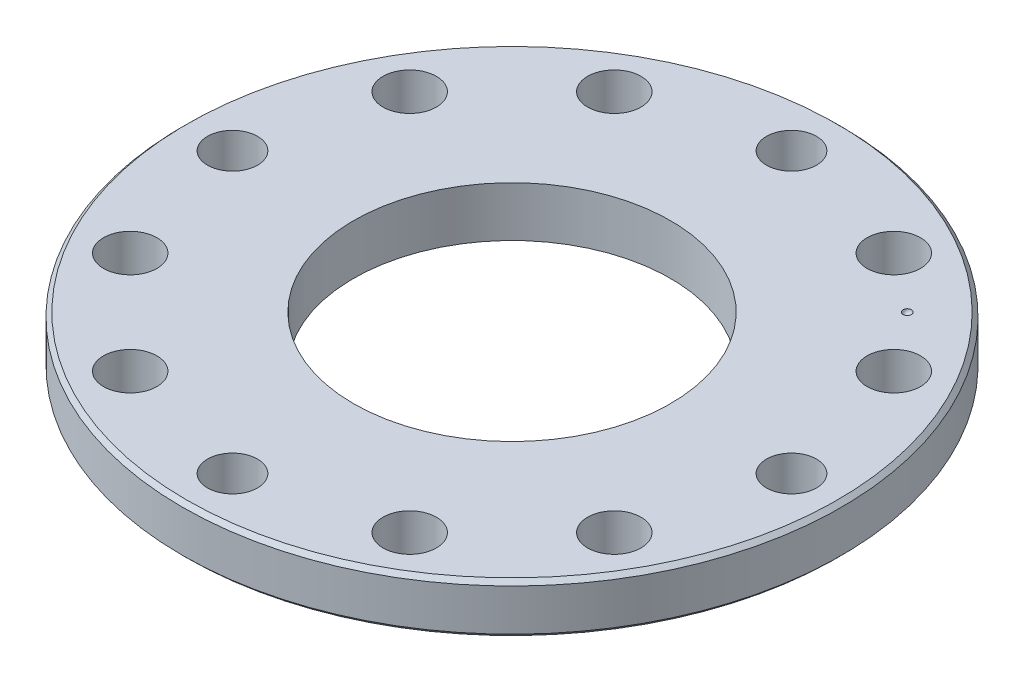
ISO-10303-21;
HEADER;
FILE_DESCRIPTION(('STEP AP214'),'2;1');
FILE_NAME('part.step','',(''),(''),'','','');
FILE_SCHEMA(('AUTOMOTIVE_DESIGN { 1 0 10303 214 1 1 1 1 }'));
ENDSEC;
DATA;
#1=APPLICATION_CONTEXT('core data for automotive mechanical design processes');
#2=APPLICATION_PROTOCOL_DEFINITION('international standard','automotive_design',2000,#1);
#3=PRODUCT_CONTEXT('',#1,'mechanical');
#4=PRODUCT('Part','Part','',(#3));
#5=PRODUCT_RELATED_PRODUCT_CATEGORY('part','',(#4));
#6=PRODUCT_DEFINITION_FORMATION('','',#4);
#7=PRODUCT_DEFINITION_CONTEXT('part definition',#1,'design');
#8=PRODUCT_DEFINITION('design','',#6,#7);
#9=PRODUCT_DEFINITION_SHAPE('','',#8);
#10=(LENGTH_UNIT() NAMED_UNIT(*) SI_UNIT(.MILLI.,.METRE.));
#11=(NAMED_UNIT(*) PLANE_ANGLE_UNIT() SI_UNIT($,.RADIAN.));
#12=(NAMED_UNIT(*) SI_UNIT($,.STERADIAN.) SOLID_ANGLE_UNIT());
#13=UNCERTAINTY_MEASURE_WITH_UNIT(LENGTH_MEASURE(1.E-05),#10,'distance_accuracy_value','');
#14=(GEOMETRIC_REPRESENTATION_CONTEXT(3) GLOBAL_UNCERTAINTY_ASSIGNED_CONTEXT((#13)) GLOBAL_UNIT_ASSIGNED_CONTEXT((#10,
#11,#12)) REPRESENTATION_CONTEXT('',''));
#15=CARTESIAN_POINT('',(0.,0.,0.));
#16=DIRECTION('',(0.,0.,1.));
#17=DIRECTION('',(1.,0.,0.));
#18=AXIS2_PLACEMENT_3D('',#15,#16,#17);
#19=CARTESIAN_POINT('',(0.,-6.,0.));
#20=DIRECTION('',(0.,1.,0.));
#21=DIRECTION('',(0.,0.,1.));
#22=AXIS2_PLACEMENT_3D('',#19,#20,#21);
#23=CYLINDRICAL_SURFACE('',#22,39.5);
#24=CARTESIAN_POINT('',(0.,-0.49999999999998,0.));
#25=DIRECTION('',(0.,1.,0.));
#26=DIRECTION('',(0.,0.,1.));
#27=AXIS2_PLACEMENT_3D('',#24,#25,#26);
#28=CIRCLE('',#27,39.5);
#29=CARTESIAN_POINT('',(0.,-0.49999999999998,39.5));
#30=VERTEX_POINT('',#29);
#31=EDGE_CURVE('E38',#30,#30,#28,.F.);
#32=ORIENTED_EDGE('',*,*,#31,.T.);
#33=EDGE_LOOP('',(#32));
#34=FACE_BOUND('',#33,.T.);
#35=CARTESIAN_POINT('',(0.,-5.49999999999999,0.));
#36=DIRECTION('',(0.,1.,0.));
#37=DIRECTION('',(0.,0.,1.));
#38=AXIS2_PLACEMENT_3D('',#35,#36,#37);
#39=CIRCLE('',#38,39.5);
#40=CARTESIAN_POINT('',(0.,-5.49999999999999,39.5));
#41=VERTEX_POINT('',#40);
#42=EDGE_CURVE('E42',#41,#41,#39,.T.);
#43=ORIENTED_EDGE('',*,*,#42,.T.);
#44=EDGE_LOOP('',(#43));
#45=FACE_BOUND('',#44,.T.);
#46=ADVANCED_FACE('F30',(#34,#45),#23,.T.);
#47=CARTESIAN_POINT('',(0.,-6.,0.));
#48=DIRECTION('',(0.,1.,0.));
#49=DIRECTION('',(0.,0.,1.));
#50=AXIS2_PLACEMENT_3D('',#47,#48,#49);
#51=PLANE('',#50);
#52=CARTESIAN_POINT('',(0.,-6.,0.));
#53=DIRECTION('',(0.,1.,0.));
#54=DIRECTION('',(0.,0.,1.));
#55=AXIS2_PLACEMENT_3D('',#52,#53,#54);
#56=CIRCLE('',#55,39.);
#57=CARTESIAN_POINT('',(0.,-6.,39.));
#58=VERTEX_POINT('',#57);
#59=EDGE_CURVE('E10',#58,#58,#56,.F.);
#60=ORIENTED_EDGE('',*,*,#59,.T.);
#61=EDGE_LOOP('',(#60));
#62=FACE_BOUND('',#61,.T.);
#63=CARTESIAN_POINT('',(-16.75,-6.,29.0118510267787));
#64=DIRECTION('',(0.,1.,0.));
#65=DIRECTION('',(0.,0.,1.));
#66=AXIS2_PLACEMENT_3D('',#63,#64,#65);
#67=CIRCLE('',#66,3.2);
#68=CARTESIAN_POINT('',(-16.75,-6.,32.2118510267787));
#69=VERTEX_POINT('',#68);
#70=EDGE_CURVE('E122',#69,#69,#67,.T.);
#71=ORIENTED_EDGE('',*,*,#70,.T.);
#72=EDGE_LOOP('',(#71));
#73=FACE_BOUND('',#72,.T.);
#74=CARTESIAN_POINT('',(-29.0118510267787,-6.,-16.75));
#75=DIRECTION('',(0.,1.,0.));
#76=DIRECTION('',(0.,0.,1.));
#77=AXIS2_PLACEMENT_3D('',#74,#75,#76);
#78=CIRCLE('',#77,3.2);
#79=CARTESIAN_POINT('',(-29.0118510267787,-6.,-13.55));
#80=VERTEX_POINT('',#79);
#81=EDGE_CURVE('E116',#80,#80,#78,.T.);
#82=ORIENTED_EDGE('',*,*,#81,.T.);
#83=EDGE_LOOP('',(#82));
#84=FACE_BOUND('',#83,.T.);
#85=CARTESIAN_POINT('',(16.75,-6.,-29.0118510267787));
#86=DIRECTION('',(0.,1.,0.));
#87=DIRECTION('',(0.,0.,1.));
#88=AXIS2_PLACEMENT_3D('',#85,#86,#87);
#89=CIRCLE('',#88,3.2);
#90=CARTESIAN_POINT('',(16.75,-6.,-25.8118510267787));
#91=VERTEX_POINT('',#90);
#92=EDGE_CURVE('E110',#91,#91,#89,.T.);
#93=ORIENTED_EDGE('',*,*,#92,.T.);
#94=EDGE_LOOP('',(#93));
#95=FACE_BOUND('',#94,.T.);
#96=CARTESIAN_POINT('',(29.0118510267787,-6.,16.75));
#97=DIRECTION('',(0.,1.,0.));
#98=DIRECTION('',(0.,0.,1.));
#99=AXIS2_PLACEMENT_3D('',#96,#97,#98);
#100=CIRCLE('',#99,3.2);
#101=CARTESIAN_POINT('',(29.0118510267787,-6.,19.95));
#102=VERTEX_POINT('',#101);
#103=EDGE_CURVE('E104',#102,#102,#100,.T.);
#104=ORIENTED_EDGE('',*,*,#103,.T.);
#105=EDGE_LOOP('',(#104));
#106=FACE_BOUND('',#105,.T.);
#107=CARTESIAN_POINT('',(-16.75,-6.,-29.0118510267787));
#108=DIRECTION('',(0.,1.,0.));
#109=DIRECTION('',(0.,0.,1.));
#110=AXIS2_PLACEMENT_3D('',#107,#108,#109);
#111=CIRCLE('',#110,3.2);
#112=CARTESIAN_POINT('',(-16.75,-6.,-25.8118510267787));
#113=VERTEX_POINT('',#112);
#114=EDGE_CURVE('E98',#113,#113,#111,.T.);
#115=ORIENTED_EDGE('',*,*,#114,.T.);
#116=EDGE_LOOP('',(#115));
#117=FACE_BOUND('',#116,.T.);
#118=CARTESIAN_POINT('',(29.0118510267787,-6.,-16.75));
#119=DIRECTION('',(0.,1.,0.));
#120=DIRECTION('',(0.,0.,1.));
#121=AXIS2_PLACEMENT_3D('',#118,#119,#120);
#122=CIRCLE('',#121,3.2);
#123=CARTESIAN_POINT('',(29.0118510267787,-6.,-13.55));
#124=VERTEX_POINT('',#123);
#125=EDGE_CURVE('E92',#124,#124,#122,.T.);
#126=ORIENTED_EDGE('',*,*,#125,.T.);
#127=EDGE_LOOP('',(#126));
#128=FACE_BOUND('',#127,.T.);
#129=CARTESIAN_POINT('',(16.75,-6.,29.0118510267787));
#130=DIRECTION('',(0.,1.,0.));
#131=DIRECTION('',(0.,0.,1.));
#132=AXIS2_PLACEMENT_3D('',#129,#130,#131);
#133=CIRCLE('',#132,3.2);
#134=CARTESIAN_POINT('',(16.75,-6.,32.2118510267787));
#135=VERTEX_POINT('',#134);
#136=EDGE_CURVE('E86',#135,#135,#133,.T.);
#137=ORIENTED_EDGE('',*,*,#136,.T.);
#138=EDGE_LOOP('',(#137));
#139=FACE_BOUND('',#138,.T.);
#140=CARTESIAN_POINT('',(-29.0118510267787,-6.,16.75));
#141=DIRECTION('',(0.,1.,0.));
#142=DIRECTION('',(0.,0.,1.));
#143=AXIS2_PLACEMENT_3D('',#140,#141,#142);
#144=CIRCLE('',#143,3.2);
#145=CARTESIAN_POINT('',(-29.0118510267787,-6.,19.95));
#146=VERTEX_POINT('',#145);
#147=EDGE_CURVE('E78',#146,#146,#144,.T.);
#148=ORIENTED_EDGE('',*,*,#147,.T.);
#149=EDGE_LOOP('',(#148));
#150=FACE_BOUND('',#149,.T.);
#151=CARTESIAN_POINT('',(0.,-6.,33.5));
#152=DIRECTION('',(0.,1.,0.));
#153=DIRECTION('',(0.,0.,1.));
#154=AXIS2_PLACEMENT_3D('',#151,#152,#153);
#155=CIRCLE('',#154,3.00000000000036);
#156=CARTESIAN_POINT('',(0.,-6.,36.5000000000004));
#157=VERTEX_POINT('',#156);
#158=EDGE_CURVE('E72',#157,#157,#155,.T.);
#159=ORIENTED_EDGE('',*,*,#158,.T.);
#160=EDGE_LOOP('',(#159));
#161=FACE_BOUND('',#160,.T.);
#162=CARTESIAN_POINT('',(-33.5,-6.,0.));
#163=DIRECTION('',(0.,1.,0.));
#164=DIRECTION('',(0.,0.,1.));
#165=AXIS2_PLACEMENT_3D('',#162,#163,#164);
#166=CIRCLE('',#165,2.9999999999999);
#167=CARTESIAN_POINT('',(-33.5,-6.,2.9999999999999));
#168=VERTEX_POINT('',#167);
#169=EDGE_CURVE('E66',#168,#168,#166,.T.);
#170=ORIENTED_EDGE('',*,*,#169,.T.);
#171=EDGE_LOOP('',(#170));
#172=FACE_BOUND('',#171,.T.);
#173=CARTESIAN_POINT('',(33.5,-6.,0.));
#174=DIRECTION('',(0.,1.,0.));
#175=DIRECTION('',(0.,0.,1.));
#176=AXIS2_PLACEMENT_3D('',#173,#174,#175);
#177=CIRCLE('',#176,3.00000000000011);
#178=CARTESIAN_POINT('',(33.5,-6.,3.00000000000011));
#179=VERTEX_POINT('',#178);
#180=EDGE_CURVE('E60',#179,#179,#177,.T.);
#181=ORIENTED_EDGE('',*,*,#180,.T.);
#182=EDGE_LOOP('',(#181));
#183=FACE_BOUND('',#182,.T.);
#184=CARTESIAN_POINT('',(0.,-6.,-33.5));
#185=DIRECTION('',(0.,1.,0.));
#186=DIRECTION('',(0.,0.,1.));
#187=AXIS2_PLACEMENT_3D('',#184,#185,#186);
#188=CIRCLE('',#187,2.99999999999964);
#189=CARTESIAN_POINT('',(0.,-6.,-30.5000000000004));
#190=VERTEX_POINT('',#189);
#191=EDGE_CURVE('E54',#190,#190,#188,.T.);
#192=ORIENTED_EDGE('',*,*,#191,.T.);
#193=EDGE_LOOP('',(#192));
#194=FACE_BOUND('',#193,.T.);
#195=CARTESIAN_POINT('',(0.,-6.,0.));
#196=DIRECTION('',(0.,1.,0.));
#197=DIRECTION('',(0.,0.,1.));
#198=AXIS2_PLACEMENT_3D('',#195,#196,#197);
#199=CIRCLE('',#198,19.);
#200=CARTESIAN_POINT('',(0.,-6.,19.));
#201=VERTEX_POINT('',#200);
#202=EDGE_CURVE('E50',#201,#201,#199,.T.);
#203=ORIENTED_EDGE('',*,*,#202,.T.);
#204=EDGE_LOOP('',(#203));
#205=FACE_BOUND('',#204,.T.);
#206=ADVANCED_FACE('F138',(#62,#73,#84,#95,#106,#117,#128,#139,#150,#161,#172,#183,#194,#205),
#51,.F.);
#207=CARTESIAN_POINT('',(0.,0.,0.));
#208=DIRECTION('',(0.,1.,0.));
#209=DIRECTION('',(0.,0.,1.));
#210=AXIS2_PLACEMENT_3D('',#207,#208,#209);
#211=PLANE('',#210);
#212=CARTESIAN_POINT('',(23.6880771697494,0.,-23.6880771697493));
#213=DIRECTION('',(0.,1.,0.));
#214=DIRECTION('',(0.,0.,1.));
#215=AXIS2_PLACEMENT_3D('',#212,#213,#214);
#216=CIRCLE('',#215,0.500000000000001);
#217=CARTESIAN_POINT('',(23.6880771697494,0.,-23.1880771697493));
#218=VERTEX_POINT('',#217);
#219=EDGE_CURVE('E34',#218,#218,#216,.T.);
#220=ORIENTED_EDGE('',*,*,#219,.F.);
#221=EDGE_LOOP('',(#220));
#222=FACE_BOUND('',#221,.T.);
#223=CARTESIAN_POINT('',(0.,0.,0.));
#224=DIRECTION('',(0.,1.,0.));
#225=DIRECTION('',(0.,0.,1.));
#226=AXIS2_PLACEMENT_3D('',#223,#224,#225);
#227=CIRCLE('',#226,39.);
#228=CARTESIAN_POINT('',(0.,0.,39.));
#229=VERTEX_POINT('',#228);
#230=EDGE_CURVE('E47',#229,#229,#227,.T.);
#231=ORIENTED_EDGE('',*,*,#230,.T.);
#232=EDGE_LOOP('',(#231));
#233=FACE_BOUND('',#232,.T.);
#234=CARTESIAN_POINT('',(-16.75,0.,29.0118510267787));
#235=DIRECTION('',(0.,1.,0.));
#236=DIRECTION('',(0.,0.,1.));
#237=AXIS2_PLACEMENT_3D('',#234,#235,#236);
#238=CIRCLE('',#237,3.19999999999999);
#239=CARTESIAN_POINT('',(-16.75,0.,32.2118510267787));
#240=VERTEX_POINT('',#239);
#241=EDGE_CURVE('E125',#240,#240,#238,.T.);
#242=ORIENTED_EDGE('',*,*,#241,.F.);
#243=EDGE_LOOP('',(#242));
#244=FACE_BOUND('',#243,.T.);
#245=CARTESIAN_POINT('',(-29.0118510267787,0.,-16.75));
#246=DIRECTION('',(0.,1.,0.));
#247=DIRECTION('',(0.,0.,1.));
#248=AXIS2_PLACEMENT_3D('',#245,#246,#247);
#249=CIRCLE('',#248,3.19999999999999);
#250=CARTESIAN_POINT('',(-29.0118510267787,0.,-13.55));
#251=VERTEX_POINT('',#250);
#252=EDGE_CURVE('E119',#251,#251,#249,.T.);
#253=ORIENTED_EDGE('',*,*,#252,.F.);
#254=EDGE_LOOP('',(#253));
#255=FACE_BOUND('',#254,.T.);
#256=CARTESIAN_POINT('',(16.75,0.,-29.0118510267787));
#257=DIRECTION('',(0.,1.,0.));
#258=DIRECTION('',(0.,0.,1.));
#259=AXIS2_PLACEMENT_3D('',#256,#257,#258);
#260=CIRCLE('',#259,3.19999999999999);
#261=CARTESIAN_POINT('',(16.75,0.,-25.8118510267787));
#262=VERTEX_POINT('',#261);
#263=EDGE_CURVE('E113',#262,#262,#260,.T.);
#264=ORIENTED_EDGE('',*,*,#263,.F.);
#265=EDGE_LOOP('',(#264));
#266=FACE_BOUND('',#265,.T.);
#267=CARTESIAN_POINT('',(29.0118510267787,0.,16.75));
#268=DIRECTION('',(0.,1.,0.));
#269=DIRECTION('',(0.,0.,1.));
#270=AXIS2_PLACEMENT_3D('',#267,#268,#269);
#271=CIRCLE('',#270,3.19999999999999);
#272=CARTESIAN_POINT('',(29.0118510267787,0.,19.95));
#273=VERTEX_POINT('',#272);
#274=EDGE_CURVE('E107',#273,#273,#271,.T.);
#275=ORIENTED_EDGE('',*,*,#274,.F.);
#276=EDGE_LOOP('',(#275));
#277=FACE_BOUND('',#276,.T.);
#278=CARTESIAN_POINT('',(-16.75,0.,-29.0118510267787));
#279=DIRECTION('',(0.,1.,0.));
#280=DIRECTION('',(0.,0.,1.));
#281=AXIS2_PLACEMENT_3D('',#278,#279,#280);
#282=CIRCLE('',#281,3.19999999999999);
#283=CARTESIAN_POINT('',(-16.75,0.,-25.8118510267787));
#284=VERTEX_POINT('',#283);
#285=EDGE_CURVE('E101',#284,#284,#282,.T.);
#286=ORIENTED_EDGE('',*,*,#285,.F.);
#287=EDGE_LOOP('',(#286));
#288=FACE_BOUND('',#287,.T.);
#289=CARTESIAN_POINT('',(29.0118510267787,0.,-16.75));
#290=DIRECTION('',(0.,1.,0.));
#291=DIRECTION('',(0.,0.,1.));
#292=AXIS2_PLACEMENT_3D('',#289,#290,#291);
#293=CIRCLE('',#292,3.19999999999998);
#294=CARTESIAN_POINT('',(29.0118510267787,0.,-13.55));
#295=VERTEX_POINT('',#294);
#296=EDGE_CURVE('E95',#295,#295,#293,.T.);
#297=ORIENTED_EDGE('',*,*,#296,.F.);
#298=EDGE_LOOP('',(#297));
#299=FACE_BOUND('',#298,.T.);
#300=CARTESIAN_POINT('',(16.75,0.,29.0118510267787));
#301=DIRECTION('',(0.,1.,0.));
#302=DIRECTION('',(0.,0.,1.));
#303=AXIS2_PLACEMENT_3D('',#300,#301,#302);
#304=CIRCLE('',#303,3.19999999999999);
#305=CARTESIAN_POINT('',(16.75,0.,32.2118510267787));
#306=VERTEX_POINT('',#305);
#307=EDGE_CURVE('E89',#306,#306,#304,.T.);
#308=ORIENTED_EDGE('',*,*,#307,.F.);
#309=EDGE_LOOP('',(#308));
#310=FACE_BOUND('',#309,.T.);
#311=CARTESIAN_POINT('',(-29.0118510267787,0.,16.75));
#312=DIRECTION('',(0.,1.,0.));
#313=DIRECTION('',(0.,0.,1.));
#314=AXIS2_PLACEMENT_3D('',#311,#312,#313);
#315=CIRCLE('',#314,3.19999999999999);
#316=CARTESIAN_POINT('',(-29.0118510267787,0.,19.95));
#317=VERTEX_POINT('',#316);
#318=EDGE_CURVE('E83',#317,#317,#315,.T.);
#319=ORIENTED_EDGE('',*,*,#318,.F.);
#320=EDGE_LOOP('',(#319));
#321=FACE_BOUND('',#320,.T.);
#322=CARTESIAN_POINT('',(0.,0.,33.5));
#323=DIRECTION('',(0.,1.,0.));
#324=DIRECTION('',(0.,0.,1.));
#325=AXIS2_PLACEMENT_3D('',#322,#323,#324);
#326=CIRCLE('',#325,3.00000000000036);
#327=CARTESIAN_POINT('',(0.,0.,36.5000000000004));
#328=VERTEX_POINT('',#327);
#329=EDGE_CURVE('E75',#328,#328,#326,.T.);
#330=ORIENTED_EDGE('',*,*,#329,.F.);
#331=EDGE_LOOP('',(#330));
#332=FACE_BOUND('',#331,.T.);
#333=CARTESIAN_POINT('',(-33.5,0.,0.));
#334=DIRECTION('',(0.,1.,0.));
#335=DIRECTION('',(0.,0.,1.));
#336=AXIS2_PLACEMENT_3D('',#333,#334,#335);
#337=CIRCLE('',#336,2.9999999999999);
#338=CARTESIAN_POINT('',(-33.5,0.,2.9999999999999));
#339=VERTEX_POINT('',#338);
#340=EDGE_CURVE('E69',#339,#339,#337,.T.);
#341=ORIENTED_EDGE('',*,*,#340,.F.);
#342=EDGE_LOOP('',(#341));
#343=FACE_BOUND('',#342,.T.);
#344=CARTESIAN_POINT('',(33.5,0.,0.));
#345=DIRECTION('',(0.,1.,0.));
#346=DIRECTION('',(0.,0.,1.));
#347=AXIS2_PLACEMENT_3D('',#344,#345,#346);
#348=CIRCLE('',#347,3.00000000000011);
#349=CARTESIAN_POINT('',(33.5,0.,3.00000000000011));
#350=VERTEX_POINT('',#349);
#351=EDGE_CURVE('E63',#350,#350,#348,.T.);
#352=ORIENTED_EDGE('',*,*,#351,.F.);
#353=EDGE_LOOP('',(#352));
#354=FACE_BOUND('',#353,.T.);
#355=CARTESIAN_POINT('',(0.,0.,-33.5));
#356=DIRECTION('',(0.,1.,0.));
#357=DIRECTION('',(0.,0.,1.));
#358=AXIS2_PLACEMENT_3D('',#355,#356,#357);
#359=CIRCLE('',#358,2.99999999999964);
#360=CARTESIAN_POINT('',(0.,0.,-30.5000000000004));
#361=VERTEX_POINT('',#360);
#362=EDGE_CURVE('E57',#361,#361,#359,.T.);
#363=ORIENTED_EDGE('',*,*,#362,.F.);
#364=EDGE_LOOP('',(#363));
#365=FACE_BOUND('',#364,.T.);
#366=CARTESIAN_POINT('',(0.,0.,0.));
#367=DIRECTION('',(0.,1.,0.));
#368=DIRECTION('',(0.,0.,1.));
#369=AXIS2_PLACEMENT_3D('',#366,#367,#368);
#370=CIRCLE('',#369,19.);
#371=CARTESIAN_POINT('',(0.,0.,19.));
#372=VERTEX_POINT('',#371);
#373=EDGE_CURVE('E51',#372,#372,#370,.T.);
#374=ORIENTED_EDGE('',*,*,#373,.F.);
#375=EDGE_LOOP('',(#374));
#376=FACE_BOUND('',#375,.T.);
#377=ADVANCED_FACE('F134',(#222,#233,#244,#255,#266,#277,#288,#299,#310,#321,#332,#343,#354,
#365,#376),#211,.T.);
#378=CARTESIAN_POINT('',(0.,-6.,0.));
#379=DIRECTION('',(0.,1.,0.));
#380=DIRECTION('',(0.,0.,1.));
#381=AXIS2_PLACEMENT_3D('',#378,#379,#380);
#382=CYLINDRICAL_SURFACE('',#381,19.);
#383=ORIENTED_EDGE('',*,*,#202,.F.);
#384=EDGE_LOOP('',(#383));
#385=FACE_BOUND('',#384,.T.);
#386=ORIENTED_EDGE('',*,*,#373,.T.);
#387=EDGE_LOOP('',(#386));
#388=FACE_BOUND('',#387,.T.);
#389=ADVANCED_FACE('F137',(#385,#388),#382,.F.);
#390=CARTESIAN_POINT('',(0.,-6.,-33.5));
#391=DIRECTION('',(0.,1.,0.));
#392=DIRECTION('',(0.,0.,1.));
#393=AXIS2_PLACEMENT_3D('',#390,#391,#392);
#394=CYLINDRICAL_SURFACE('',#393,2.99999999999964);
#395=ORIENTED_EDGE('',*,*,#191,.F.);
#396=EDGE_LOOP('',(#395));
#397=FACE_BOUND('',#396,.T.);
#398=ORIENTED_EDGE('',*,*,#362,.T.);
#399=EDGE_LOOP('',(#398));
#400=FACE_BOUND('',#399,.T.);
#401=ADVANCED_FACE('F168',(#397,#400),#394,.F.);
#402=CARTESIAN_POINT('',(33.5,-6.,0.));
#403=DIRECTION('',(0.,1.,0.));
#404=DIRECTION('',(0.,0.,1.));
#405=AXIS2_PLACEMENT_3D('',#402,#403,#404);
#406=CYLINDRICAL_SURFACE('',#405,3.00000000000011);
#407=ORIENTED_EDGE('',*,*,#180,.F.);
#408=EDGE_LOOP('',(#407));
#409=FACE_BOUND('',#408,.T.);
#410=ORIENTED_EDGE('',*,*,#351,.T.);
#411=EDGE_LOOP('',(#410));
#412=FACE_BOUND('',#411,.T.);
#413=ADVANCED_FACE('F174',(#409,#412),#406,.F.);
#414=CARTESIAN_POINT('',(-33.5,-6.,0.));
#415=DIRECTION('',(0.,1.,0.));
#416=DIRECTION('',(0.,0.,1.));
#417=AXIS2_PLACEMENT_3D('',#414,#415,#416);
#418=CYLINDRICAL_SURFACE('',#417,2.9999999999999);
#419=ORIENTED_EDGE('',*,*,#169,.F.);
#420=EDGE_LOOP('',(#419));
#421=FACE_BOUND('',#420,.T.);
#422=ORIENTED_EDGE('',*,*,#340,.T.);
#423=EDGE_LOOP('',(#422));
#424=FACE_BOUND('',#423,.T.);
#425=ADVANCED_FACE('F235',(#421,#424),#418,.F.);
#426=CARTESIAN_POINT('',(0.,-6.,33.5));
#427=DIRECTION('',(0.,1.,0.));
#428=DIRECTION('',(0.,0.,1.));
#429=AXIS2_PLACEMENT_3D('',#426,#427,#428);
#430=CYLINDRICAL_SURFACE('',#429,3.00000000000036);
#431=ORIENTED_EDGE('',*,*,#158,.F.);
#432=EDGE_LOOP('',(#431));
#433=FACE_BOUND('',#432,.T.);
#434=ORIENTED_EDGE('',*,*,#329,.T.);
#435=EDGE_LOOP('',(#434));
#436=FACE_BOUND('',#435,.T.);
#437=ADVANCED_FACE('F231',(#433,#436),#430,.F.);
#438=CARTESIAN_POINT('',(-29.0118510267787,0.,16.75));
#439=DIRECTION('',(0.,1.,0.));
#440=DIRECTION('',(0.,0.,1.));
#441=AXIS2_PLACEMENT_3D('',#438,#439,#440);
#442=CYLINDRICAL_SURFACE('',#441,3.19999999999999);
#443=ORIENTED_EDGE('',*,*,#147,.F.);
#444=EDGE_LOOP('',(#443));
#445=FACE_BOUND('',#444,.T.);
#446=ORIENTED_EDGE('',*,*,#318,.T.);
#447=EDGE_LOOP('',(#446));
#448=FACE_BOUND('',#447,.T.);
#449=ADVANCED_FACE('F227',(#445,#448),#442,.F.);
#450=CARTESIAN_POINT('',(16.75,0.,29.0118510267787));
#451=DIRECTION('',(0.,1.,0.));
#452=DIRECTION('',(0.,0.,1.));
#453=AXIS2_PLACEMENT_3D('',#450,#451,#452);
#454=CYLINDRICAL_SURFACE('',#453,3.19999999999999);
#455=ORIENTED_EDGE('',*,*,#136,.F.);
#456=EDGE_LOOP('',(#455));
#457=FACE_BOUND('',#456,.T.);
#458=ORIENTED_EDGE('',*,*,#307,.T.);
#459=EDGE_LOOP('',(#458));
#460=FACE_BOUND('',#459,.T.);
#461=ADVANCED_FACE('F223',(#457,#460),#454,.F.);
#462=CARTESIAN_POINT('',(29.0118510267787,0.,-16.75));
#463=DIRECTION('',(0.,1.,0.));
#464=DIRECTION('',(0.,0.,1.));
#465=AXIS2_PLACEMENT_3D('',#462,#463,#464);
#466=CYLINDRICAL_SURFACE('',#465,3.19999999999999);
#467=ORIENTED_EDGE('',*,*,#125,.F.);
#468=EDGE_LOOP('',(#467));
#469=FACE_BOUND('',#468,.T.);
#470=ORIENTED_EDGE('',*,*,#296,.T.);
#471=EDGE_LOOP('',(#470));
#472=FACE_BOUND('',#471,.T.);
#473=ADVANCED_FACE('F219',(#469,#472),#466,.F.);
#474=CARTESIAN_POINT('',(-16.75,0.,-29.0118510267787));
#475=DIRECTION('',(0.,1.,0.));
#476=DIRECTION('',(0.,0.,1.));
#477=AXIS2_PLACEMENT_3D('',#474,#475,#476);
#478=CYLINDRICAL_SURFACE('',#477,3.19999999999999);
#479=ORIENTED_EDGE('',*,*,#114,.F.);
#480=EDGE_LOOP('',(#479));
#481=FACE_BOUND('',#480,.T.);
#482=ORIENTED_EDGE('',*,*,#285,.T.);
#483=EDGE_LOOP('',(#482));
#484=FACE_BOUND('',#483,.T.);
#485=ADVANCED_FACE('F215',(#481,#484),#478,.F.);
#486=CARTESIAN_POINT('',(29.0118510267787,0.,16.75));
#487=DIRECTION('',(0.,1.,0.));
#488=DIRECTION('',(0.,0.,1.));
#489=AXIS2_PLACEMENT_3D('',#486,#487,#488);
#490=CYLINDRICAL_SURFACE('',#489,3.19999999999999);
#491=ORIENTED_EDGE('',*,*,#103,.F.);
#492=EDGE_LOOP('',(#491));
#493=FACE_BOUND('',#492,.T.);
#494=ORIENTED_EDGE('',*,*,#274,.T.);
#495=EDGE_LOOP('',(#494));
#496=FACE_BOUND('',#495,.T.);
#497=ADVANCED_FACE('F211',(#493,#496),#490,.F.);
#498=CARTESIAN_POINT('',(16.75,0.,-29.0118510267787));
#499=DIRECTION('',(0.,1.,0.));
#500=DIRECTION('',(0.,0.,1.));
#501=AXIS2_PLACEMENT_3D('',#498,#499,#500);
#502=CYLINDRICAL_SURFACE('',#501,3.19999999999999);
#503=ORIENTED_EDGE('',*,*,#92,.F.);
#504=EDGE_LOOP('',(#503));
#505=FACE_BOUND('',#504,.T.);
#506=ORIENTED_EDGE('',*,*,#263,.T.);
#507=EDGE_LOOP('',(#506));
#508=FACE_BOUND('',#507,.T.);
#509=ADVANCED_FACE('F203',(#505,#508),#502,.F.);
#510=CARTESIAN_POINT('',(-29.0118510267787,0.,-16.75));
#511=DIRECTION('',(0.,1.,0.));
#512=DIRECTION('',(0.,0.,1.));
#513=AXIS2_PLACEMENT_3D('',#510,#511,#512);
#514=CYLINDRICAL_SURFACE('',#513,3.19999999999999);
#515=ORIENTED_EDGE('',*,*,#81,.F.);
#516=EDGE_LOOP('',(#515));
#517=FACE_BOUND('',#516,.T.);
#518=ORIENTED_EDGE('',*,*,#252,.T.);
#519=EDGE_LOOP('',(#518));
#520=FACE_BOUND('',#519,.T.);
#521=ADVANCED_FACE('F195',(#517,#520),#514,.F.);
#522=CARTESIAN_POINT('',(-16.75,0.,29.0118510267787));
#523=DIRECTION('',(0.,1.,0.));
#524=DIRECTION('',(0.,0.,1.));
#525=AXIS2_PLACEMENT_3D('',#522,#523,#524);
#526=CYLINDRICAL_SURFACE('',#525,3.19999999999999);
#527=ORIENTED_EDGE('',*,*,#70,.F.);
#528=EDGE_LOOP('',(#527));
#529=FACE_BOUND('',#528,.T.);
#530=ORIENTED_EDGE('',*,*,#241,.T.);
#531=EDGE_LOOP('',(#530));
#532=FACE_BOUND('',#531,.T.);
#533=ADVANCED_FACE('F188',(#529,#532),#526,.F.);
#534=CARTESIAN_POINT('',(0.,0.,0.));
#535=DIRECTION('',(0.,-1.,0.));
#536=DIRECTION('',(0.,0.,-1.));
#537=AXIS2_PLACEMENT_3D('',#534,#535,#536);
#538=CONICAL_SURFACE('',#537,39.,0.785398163397448);
#539=ORIENTED_EDGE('',*,*,#31,.F.);
#540=EDGE_LOOP('',(#539));
#541=FACE_BOUND('',#540,.T.);
#542=ORIENTED_EDGE('',*,*,#230,.F.);
#543=EDGE_LOOP('',(#542));
#544=FACE_BOUND('',#543,.T.);
#545=ADVANCED_FACE('F186',(#541,#544),#538,.T.);
#546=CARTESIAN_POINT('',(0.,-5.49999999999999,0.));
#547=DIRECTION('',(0.,1.,0.));
#548=DIRECTION('',(0.,0.,1.));
#549=AXIS2_PLACEMENT_3D('',#546,#547,#548);
#550=CONICAL_SURFACE('',#549,39.5,0.785398163397448);
#551=ORIENTED_EDGE('',*,*,#59,.F.);
#552=EDGE_LOOP('',(#551));
#553=FACE_BOUND('',#552,.T.);
#554=ORIENTED_EDGE('',*,*,#42,.F.);
#555=EDGE_LOOP('',(#554));
#556=FACE_BOUND('',#555,.T.);
#557=ADVANCED_FACE('F32',(#553,#556),#550,.T.);
#558=CARTESIAN_POINT('',(23.6880771697494,0.,-23.6880771697493));
#559=DIRECTION('',(0.707106781186549,0.,-0.707106781186546));
#560=DIRECTION('',(-0.707106781186546,0.,-0.707106781186549));
#561=AXIS2_PLACEMENT_3D('',#558,#559,#560);
#562=SPHERICAL_SURFACE('',#561,0.500000000000001);
#563=CARTESIAN_POINT('',(23.6880771697494,0.,-23.6880771697493));
#564=DIRECTION('',(0.,1.,0.));
#565=DIRECTION('',(0.,0.,1.));
#566=AXIS2_PLACEMENT_3D('',#563,#564,#565);
#567=SPHERICAL_SURFACE('',#566,0.500000000000001);
#568=ORIENTED_EDGE('',*,*,#219,.T.);
#569=EDGE_LOOP('',(#568));
#570=FACE_BOUND('',#569,.T.);
#571=ADVANCED_FACE('F132',(#570),#567,.F.);
#572=CLOSED_SHELL('',(#46,#206,#377,#389,#401,#413,#425,#437,#449,#461,#473,#485,#497,#509,#521,
#533,#545,#557,#571));
#573=MANIFOLD_SOLID_BREP('B2',#572);
#574=ADVANCED_BREP_SHAPE_REPRESENTATION('',(#18,#573),#14);
#575=SHAPE_DEFINITION_REPRESENTATION(#9,#574);
ENDSEC;
END-ISO-10303-21;
